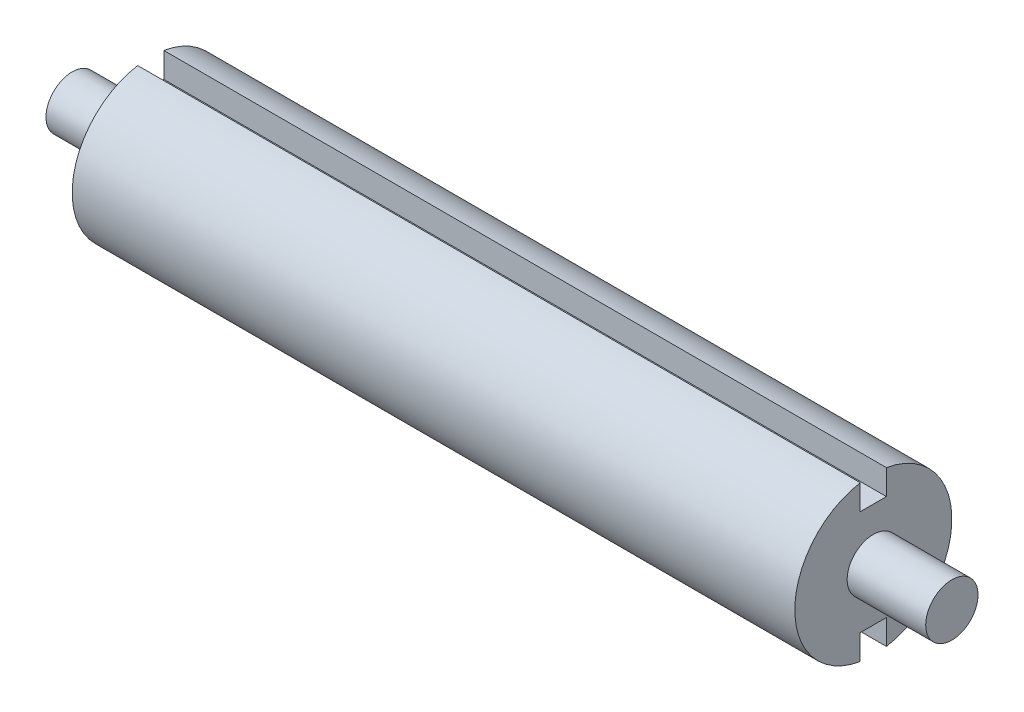
ISO-10303-21;
HEADER;
FILE_DESCRIPTION(('STEP AP214'),'2;1');
FILE_NAME('part.step','',(''),(''),'','','');
FILE_SCHEMA(('AUTOMOTIVE_DESIGN { 1 0 10303 214 1 1 1 1 }'));
ENDSEC;
DATA;
#1=APPLICATION_CONTEXT('core data for automotive mechanical design processes');
#2=APPLICATION_PROTOCOL_DEFINITION('international standard','automotive_design',2000,#1);
#3=PRODUCT_CONTEXT('',#1,'mechanical');
#4=PRODUCT('Part','Part','',(#3));
#5=PRODUCT_RELATED_PRODUCT_CATEGORY('part','',(#4));
#6=PRODUCT_DEFINITION_FORMATION('','',#4);
#7=PRODUCT_DEFINITION_CONTEXT('part definition',#1,'design');
#8=PRODUCT_DEFINITION('design','',#6,#7);
#9=PRODUCT_DEFINITION_SHAPE('','',#8);
#10=(LENGTH_UNIT() NAMED_UNIT(*) SI_UNIT(.MILLI.,.METRE.));
#11=(NAMED_UNIT(*) PLANE_ANGLE_UNIT() SI_UNIT($,.RADIAN.));
#12=(NAMED_UNIT(*) SI_UNIT($,.STERADIAN.) SOLID_ANGLE_UNIT());
#13=UNCERTAINTY_MEASURE_WITH_UNIT(LENGTH_MEASURE(1.E-05),#10,'distance_accuracy_value','');
#14=(GEOMETRIC_REPRESENTATION_CONTEXT(3) GLOBAL_UNCERTAINTY_ASSIGNED_CONTEXT((#13)) GLOBAL_UNIT_ASSIGNED_CONTEXT((#10,
#11,#12)) REPRESENTATION_CONTEXT('',''));
#15=CARTESIAN_POINT('',(0.,0.,0.));
#16=DIRECTION('',(0.,0.,1.));
#17=DIRECTION('',(1.,0.,0.));
#18=AXIS2_PLACEMENT_3D('',#15,#16,#17);
#19=CARTESIAN_POINT('',(-106.68,0.,0.));
#20=DIRECTION('',(-1.,0.,0.));
#21=DIRECTION('',(0.,0.,1.));
#22=AXIS2_PLACEMENT_3D('',#19,#20,#21);
#23=CYLINDRICAL_SURFACE('',#22,19.05);
#24=CARTESIAN_POINT('',(-87.63,0.,0.));
#25=DIRECTION('',(-1.,0.,0.));
#26=DIRECTION('',(0.,0.,1.));
#27=AXIS2_PLACEMENT_3D('',#24,#25,#26);
#28=CIRCLE('',#27,19.05);
#29=CARTESIAN_POINT('',(-87.63,18.7835533113413,-3.175));
#30=VERTEX_POINT('',#29);
#31=CARTESIAN_POINT('',(-87.63,-18.7835533113413,-3.175));
#32=VERTEX_POINT('',#31);
#33=EDGE_CURVE('E167',#30,#32,#28,.T.);
#34=ORIENTED_EDGE('',*,*,#33,.F.);
#35=DIRECTION('',(-1.,0.,0.));
#36=VECTOR('',#35,1.);
#37=CARTESIAN_POINT('',(-106.68,18.7835533113413,-3.175));
#38=LINE('',#37,#36);
#39=CARTESIAN_POINT('',(87.63,18.7835533113413,-3.175));
#40=VERTEX_POINT('',#39);
#41=EDGE_CURVE('E149',#30,#40,#38,.F.);
#42=ORIENTED_EDGE('',*,*,#41,.T.);
#43=CARTESIAN_POINT('',(87.63,0.,0.));
#44=DIRECTION('',(-1.,0.,0.));
#45=DIRECTION('',(0.,0.,1.));
#46=AXIS2_PLACEMENT_3D('',#43,#44,#45);
#47=CIRCLE('',#46,19.05);
#48=CARTESIAN_POINT('',(87.63,-18.7835533113413,-3.175));
#49=VERTEX_POINT('',#48);
#50=EDGE_CURVE('E163',#40,#49,#47,.T.);
#51=ORIENTED_EDGE('',*,*,#50,.T.);
#52=DIRECTION('',(-1.,0.,0.));
#53=VECTOR('',#52,1.);
#54=CARTESIAN_POINT('',(-106.68,-18.7835533113413,-3.175));
#55=LINE('',#54,#53);
#56=EDGE_CURVE('E49',#49,#32,#55,.T.);
#57=ORIENTED_EDGE('',*,*,#56,.T.);
#58=EDGE_LOOP('',(#34,#42,#51,#57));
#59=FACE_BOUND('',#58,.T.);
#60=ADVANCED_FACE('F34',(#59),#23,.T.);
#61=CARTESIAN_POINT('',(-106.68,0.,0.));
#62=DIRECTION('',(1.,0.,0.));
#63=DIRECTION('',(0.,0.,-1.));
#64=AXIS2_PLACEMENT_3D('',#61,#62,#63);
#65=PLANE('',#64);
#66=CARTESIAN_POINT('',(-106.68,0.,0.));
#67=DIRECTION('',(-1.,0.,0.));
#68=DIRECTION('',(0.,0.,1.));
#69=AXIS2_PLACEMENT_3D('',#66,#67,#68);
#70=CIRCLE('',#69,6.35);
#71=CARTESIAN_POINT('',(-106.68,0.,6.35));
#72=VERTEX_POINT('',#71);
#73=EDGE_CURVE('E171',#72,#72,#70,.T.);
#74=ORIENTED_EDGE('',*,*,#73,.T.);
#75=EDGE_LOOP('',(#74));
#76=FACE_BOUND('',#75,.T.);
#77=ADVANCED_FACE('F36',(#76),#65,.F.);
#78=CARTESIAN_POINT('',(-106.68,0.,0.));
#79=DIRECTION('',(-1.,0.,0.));
#80=DIRECTION('',(0.,0.,1.));
#81=AXIS2_PLACEMENT_3D('',#78,#79,#80);
#82=CYLINDRICAL_SURFACE('',#81,6.35);
#83=ORIENTED_EDGE('',*,*,#73,.F.);
#84=EDGE_LOOP('',(#83));
#85=FACE_BOUND('',#84,.T.);
#86=CARTESIAN_POINT('',(-87.63,0.,0.));
#87=DIRECTION('',(-1.,0.,0.));
#88=DIRECTION('',(0.,0.,1.));
#89=AXIS2_PLACEMENT_3D('',#86,#87,#88);
#90=CIRCLE('',#89,6.35);
#91=CARTESIAN_POINT('',(-87.63,0.,6.35));
#92=VERTEX_POINT('',#91);
#93=EDGE_CURVE('E168',#92,#92,#90,.T.);
#94=ORIENTED_EDGE('',*,*,#93,.T.);
#95=EDGE_LOOP('',(#94));
#96=FACE_BOUND('',#95,.T.);
#97=ADVANCED_FACE('F207',(#85,#96),#82,.T.);
#98=CARTESIAN_POINT('',(-87.63,0.,-6.35));
#99=DIRECTION('',(1.,0.,0.));
#100=DIRECTION('',(0.,0.,-1.));
#101=AXIS2_PLACEMENT_3D('',#98,#99,#100);
#102=PLANE('',#101);
#103=ORIENTED_EDGE('',*,*,#93,.F.);
#104=EDGE_LOOP('',(#103));
#105=FACE_BOUND('',#104,.T.);
#106=DIRECTION('',(0.,0.,-1.));
#107=VECTOR('',#106,1.);
#108=CARTESIAN_POINT('',(-87.63,12.7,-6.35));
#109=LINE('',#108,#107);
#110=CARTESIAN_POINT('',(-87.63,12.7,3.175));
#111=VERTEX_POINT('',#110);
#112=CARTESIAN_POINT('',(-87.63,12.7,-3.175));
#113=VERTEX_POINT('',#112);
#114=EDGE_CURVE('E107',#111,#113,#109,.T.);
#115=ORIENTED_EDGE('',*,*,#114,.T.);
#116=DIRECTION('',(0.,1.,0.));
#117=VECTOR('',#116,1.);
#118=CARTESIAN_POINT('',(-87.63,0.,-3.175));
#119=LINE('',#118,#117);
#120=EDGE_CURVE('E152',#113,#30,#119,.T.);
#121=ORIENTED_EDGE('',*,*,#120,.T.);
#122=ORIENTED_EDGE('',*,*,#33,.T.);
#123=DIRECTION('',(0.,1.,0.));
#124=VECTOR('',#123,1.);
#125=CARTESIAN_POINT('',(-87.63,0.,-3.175));
#126=LINE('',#125,#124);
#127=CARTESIAN_POINT('',(-87.63,-12.7,-3.175));
#128=VERTEX_POINT('',#127);
#129=EDGE_CURVE('E133',#32,#128,#126,.T.);
#130=ORIENTED_EDGE('',*,*,#129,.T.);
#131=DIRECTION('',(0.,0.,1.));
#132=VECTOR('',#131,1.);
#133=CARTESIAN_POINT('',(-87.63,-12.7,-6.35));
#134=LINE('',#133,#132);
#135=CARTESIAN_POINT('',(-87.63,-12.7,3.175));
#136=VERTEX_POINT('',#135);
#137=EDGE_CURVE('E136',#128,#136,#134,.T.);
#138=ORIENTED_EDGE('',*,*,#137,.T.);
#139=DIRECTION('',(0.,-1.,0.));
#140=VECTOR('',#139,1.);
#141=CARTESIAN_POINT('',(-87.63,0.,3.175));
#142=LINE('',#141,#140);
#143=CARTESIAN_POINT('',(-87.63,-18.7835533113413,3.175));
#144=VERTEX_POINT('',#143);
#145=EDGE_CURVE('E142',#136,#144,#142,.T.);
#146=ORIENTED_EDGE('',*,*,#145,.T.);
#147=CARTESIAN_POINT('',(-87.63,18.7835533113413,3.175));
#148=VERTEX_POINT('',#147);
#149=EDGE_CURVE('E164',#144,#148,#28,.T.);
#150=ORIENTED_EDGE('',*,*,#149,.T.);
#151=DIRECTION('',(0.,-1.,0.));
#152=VECTOR('',#151,1.);
#153=CARTESIAN_POINT('',(-87.63,0.,3.175));
#154=LINE('',#153,#152);
#155=EDGE_CURVE('E146',#148,#111,#154,.T.);
#156=ORIENTED_EDGE('',*,*,#155,.T.);
#157=EDGE_LOOP('',(#115,#121,#122,#130,#138,#146,#150,#156));
#158=FACE_BOUND('',#157,.T.);
#159=ADVANCED_FACE('F183',(#105,#158),#102,.F.);
#160=CARTESIAN_POINT('',(87.63,-18.7835533113413,3.175));
#161=VERTEX_POINT('',#160);
#162=CARTESIAN_POINT('',(87.63,18.7835533113413,3.175));
#163=VERTEX_POINT('',#162);
#164=EDGE_CURVE('E161',#161,#163,#47,.T.);
#165=ORIENTED_EDGE('',*,*,#164,.T.);
#166=DIRECTION('',(-1.,0.,0.));
#167=VECTOR('',#166,1.);
#168=CARTESIAN_POINT('',(-106.68,18.7835533113413,3.175));
#169=LINE('',#168,#167);
#170=EDGE_CURVE('E57',#163,#148,#169,.T.);
#171=ORIENTED_EDGE('',*,*,#170,.T.);
#172=ORIENTED_EDGE('',*,*,#149,.F.);
#173=DIRECTION('',(-1.,0.,0.));
#174=VECTOR('',#173,1.);
#175=CARTESIAN_POINT('',(-106.68,-18.7835533113413,3.175));
#176=LINE('',#175,#174);
#177=EDGE_CURVE('E139',#144,#161,#176,.F.);
#178=ORIENTED_EDGE('',*,*,#177,.T.);
#179=EDGE_LOOP('',(#165,#171,#172,#178));
#180=FACE_BOUND('',#179,.T.);
#181=ADVANCED_FACE('F186',(#180),#23,.T.);
#182=CARTESIAN_POINT('',(87.63,0.,-19.05));
#183=DIRECTION('',(-1.,0.,0.));
#184=DIRECTION('',(0.,0.,1.));
#185=AXIS2_PLACEMENT_3D('',#182,#183,#184);
#186=PLANE('',#185);
#187=ORIENTED_EDGE('',*,*,#50,.F.);
#188=DIRECTION('',(0.,1.,0.));
#189=VECTOR('',#188,1.);
#190=CARTESIAN_POINT('',(87.63,12.7,-3.175));
#191=LINE('',#190,#189);
#192=CARTESIAN_POINT('',(87.63,12.7,-3.175));
#193=VERTEX_POINT('',#192);
#194=EDGE_CURVE('E118',#193,#40,#191,.T.);
#195=ORIENTED_EDGE('',*,*,#194,.F.);
#196=DIRECTION('',(0.,0.,-1.));
#197=VECTOR('',#196,1.);
#198=CARTESIAN_POINT('',(87.63,12.7,3.175));
#199=LINE('',#198,#197);
#200=CARTESIAN_POINT('',(87.63,12.7,3.175));
#201=VERTEX_POINT('',#200);
#202=EDGE_CURVE('E104',#201,#193,#199,.T.);
#203=ORIENTED_EDGE('',*,*,#202,.F.);
#204=DIRECTION('',(0.,1.,0.));
#205=VECTOR('',#204,1.);
#206=CARTESIAN_POINT('',(87.63,0.,3.175));
#207=LINE('',#206,#205);
#208=EDGE_CURVE('E11',#201,#163,#207,.T.);
#209=ORIENTED_EDGE('',*,*,#208,.T.);
#210=ORIENTED_EDGE('',*,*,#164,.F.);
#211=DIRECTION('',(0.,-1.,0.));
#212=VECTOR('',#211,1.);
#213=CARTESIAN_POINT('',(87.63,-12.7,3.175));
#214=LINE('',#213,#212);
#215=CARTESIAN_POINT('',(87.63,-12.7,3.175));
#216=VERTEX_POINT('',#215);
#217=EDGE_CURVE('E124',#216,#161,#214,.T.);
#218=ORIENTED_EDGE('',*,*,#217,.F.);
#219=DIRECTION('',(0.,0.,1.));
#220=VECTOR('',#219,1.);
#221=CARTESIAN_POINT('',(87.63,-12.7,3.175));
#222=LINE('',#221,#220);
#223=CARTESIAN_POINT('',(87.63,-12.7,-3.175));
#224=VERTEX_POINT('',#223);
#225=EDGE_CURVE('E126',#224,#216,#222,.T.);
#226=ORIENTED_EDGE('',*,*,#225,.F.);
#227=DIRECTION('',(0.,-1.,0.));
#228=VECTOR('',#227,1.);
#229=CARTESIAN_POINT('',(87.63,0.,-3.175));
#230=LINE('',#229,#228);
#231=EDGE_CURVE('E42',#224,#49,#230,.T.);
#232=ORIENTED_EDGE('',*,*,#231,.T.);
#233=EDGE_LOOP('',(#187,#195,#203,#209,#210,#218,#226,#232));
#234=FACE_BOUND('',#233,.T.);
#235=CARTESIAN_POINT('',(87.63,0.,0.));
#236=DIRECTION('',(-1.,0.,0.));
#237=DIRECTION('',(0.,0.,1.));
#238=AXIS2_PLACEMENT_3D('',#235,#236,#237);
#239=CIRCLE('',#238,6.35);
#240=CARTESIAN_POINT('',(87.63,0.,6.35));
#241=VERTEX_POINT('',#240);
#242=EDGE_CURVE('E158',#241,#241,#239,.T.);
#243=ORIENTED_EDGE('',*,*,#242,.T.);
#244=EDGE_LOOP('',(#243));
#245=FACE_BOUND('',#244,.T.);
#246=ADVANCED_FACE('F116',(#234,#245),#186,.F.);
#247=CARTESIAN_POINT('',(-106.68,0.,0.));
#248=DIRECTION('',(-1.,0.,0.));
#249=DIRECTION('',(0.,0.,1.));
#250=AXIS2_PLACEMENT_3D('',#247,#248,#249);
#251=CYLINDRICAL_SURFACE('',#250,6.35);
#252=ORIENTED_EDGE('',*,*,#242,.F.);
#253=EDGE_LOOP('',(#252));
#254=FACE_BOUND('',#253,.T.);
#255=CARTESIAN_POINT('',(106.68,0.,0.));
#256=DIRECTION('',(-1.,0.,0.));
#257=DIRECTION('',(0.,0.,1.));
#258=AXIS2_PLACEMENT_3D('',#255,#256,#257);
#259=CIRCLE('',#258,6.35);
#260=CARTESIAN_POINT('',(106.68,0.,6.35));
#261=VERTEX_POINT('',#260);
#262=EDGE_CURVE('E155',#261,#261,#259,.T.);
#263=ORIENTED_EDGE('',*,*,#262,.T.);
#264=EDGE_LOOP('',(#263));
#265=FACE_BOUND('',#264,.T.);
#266=ADVANCED_FACE('F216',(#254,#265),#251,.T.);
#267=CARTESIAN_POINT('',(106.68,0.,-6.35));
#268=DIRECTION('',(-1.,0.,0.));
#269=DIRECTION('',(0.,0.,1.));
#270=AXIS2_PLACEMENT_3D('',#267,#268,#269);
#271=PLANE('',#270);
#272=ORIENTED_EDGE('',*,*,#262,.F.);
#273=EDGE_LOOP('',(#272));
#274=FACE_BOUND('',#273,.T.);
#275=ADVANCED_FACE('F257',(#274),#271,.F.);
#276=CARTESIAN_POINT('',(-106.68,-12.7,3.175));
#277=DIRECTION('',(0.,0.,1.));
#278=DIRECTION('',(1.,0.,0.));
#279=AXIS2_PLACEMENT_3D('',#276,#277,#278);
#280=PLANE('',#279);
#281=DIRECTION('',(1.,0.,0.));
#282=VECTOR('',#281,1.);
#283=CARTESIAN_POINT('',(-106.68,-12.7,3.175));
#284=LINE('',#283,#282);
#285=EDGE_CURVE('E120',#136,#216,#284,.T.);
#286=ORIENTED_EDGE('',*,*,#285,.T.);
#287=ORIENTED_EDGE('',*,*,#217,.T.);
#288=ORIENTED_EDGE('',*,*,#177,.F.);
#289=ORIENTED_EDGE('',*,*,#145,.F.);
#290=EDGE_LOOP('',(#286,#287,#288,#289));
#291=FACE_BOUND('',#290,.T.);
#292=ADVANCED_FACE('F188',(#291),#280,.F.);
#293=CARTESIAN_POINT('',(-106.68,-12.7,3.175));
#294=DIRECTION('',(0.,1.,0.));
#295=DIRECTION('',(0.,0.,1.));
#296=AXIS2_PLACEMENT_3D('',#293,#294,#295);
#297=PLANE('',#296);
#298=DIRECTION('',(1.,0.,0.));
#299=VECTOR('',#298,1.);
#300=CARTESIAN_POINT('',(-106.68,-12.7,-3.175));
#301=LINE('',#300,#299);
#302=EDGE_CURVE('E129',#128,#224,#301,.T.);
#303=ORIENTED_EDGE('',*,*,#302,.T.);
#304=ORIENTED_EDGE('',*,*,#225,.T.);
#305=ORIENTED_EDGE('',*,*,#285,.F.);
#306=ORIENTED_EDGE('',*,*,#137,.F.);
#307=EDGE_LOOP('',(#303,#304,#305,#306));
#308=FACE_BOUND('',#307,.T.);
#309=ADVANCED_FACE('F191',(#308),#297,.F.);
#310=CARTESIAN_POINT('',(-106.68,-12.7,-3.175));
#311=DIRECTION('',(0.,0.,-1.));
#312=DIRECTION('',(-1.,0.,0.));
#313=AXIS2_PLACEMENT_3D('',#310,#311,#312);
#314=PLANE('',#313);
#315=ORIENTED_EDGE('',*,*,#56,.F.);
#316=ORIENTED_EDGE('',*,*,#231,.F.);
#317=ORIENTED_EDGE('',*,*,#302,.F.);
#318=ORIENTED_EDGE('',*,*,#129,.F.);
#319=EDGE_LOOP('',(#315,#316,#317,#318));
#320=FACE_BOUND('',#319,.T.);
#321=ADVANCED_FACE('F192',(#320),#314,.F.);
#322=CARTESIAN_POINT('',(-106.68,12.7,-3.175));
#323=DIRECTION('',(0.,0.,-1.));
#324=DIRECTION('',(-1.,0.,0.));
#325=AXIS2_PLACEMENT_3D('',#322,#323,#324);
#326=PLANE('',#325);
#327=DIRECTION('',(1.,0.,0.));
#328=VECTOR('',#327,1.);
#329=CARTESIAN_POINT('',(-106.68,12.7,-3.175));
#330=LINE('',#329,#328);
#331=EDGE_CURVE('E109',#113,#193,#330,.T.);
#332=ORIENTED_EDGE('',*,*,#331,.T.);
#333=ORIENTED_EDGE('',*,*,#194,.T.);
#334=ORIENTED_EDGE('',*,*,#41,.F.);
#335=ORIENTED_EDGE('',*,*,#120,.F.);
#336=EDGE_LOOP('',(#332,#333,#334,#335));
#337=FACE_BOUND('',#336,.T.);
#338=ADVANCED_FACE('F181',(#337),#326,.F.);
#339=CARTESIAN_POINT('',(-106.68,12.7,3.175));
#340=DIRECTION('',(0.,-1.,0.));
#341=DIRECTION('',(0.,0.,-1.));
#342=AXIS2_PLACEMENT_3D('',#339,#340,#341);
#343=PLANE('',#342);
#344=DIRECTION('',(1.,0.,0.));
#345=VECTOR('',#344,1.);
#346=CARTESIAN_POINT('',(-106.68,12.7,3.175));
#347=LINE('',#346,#345);
#348=EDGE_CURVE('E100',#111,#201,#347,.T.);
#349=ORIENTED_EDGE('',*,*,#348,.T.);
#350=ORIENTED_EDGE('',*,*,#202,.T.);
#351=ORIENTED_EDGE('',*,*,#331,.F.);
#352=ORIENTED_EDGE('',*,*,#114,.F.);
#353=EDGE_LOOP('',(#349,#350,#351,#352));
#354=FACE_BOUND('',#353,.T.);
#355=ADVANCED_FACE('F101',(#354),#343,.F.);
#356=CARTESIAN_POINT('',(-106.68,12.7,3.175));
#357=DIRECTION('',(0.,0.,1.));
#358=DIRECTION('',(1.,0.,0.));
#359=AXIS2_PLACEMENT_3D('',#356,#357,#358);
#360=PLANE('',#359);
#361=ORIENTED_EDGE('',*,*,#170,.F.);
#362=ORIENTED_EDGE('',*,*,#208,.F.);
#363=ORIENTED_EDGE('',*,*,#348,.F.);
#364=ORIENTED_EDGE('',*,*,#155,.F.);
#365=EDGE_LOOP('',(#361,#362,#363,#364));
#366=FACE_BOUND('',#365,.T.);
#367=ADVANCED_FACE('F111',(#366),#360,.F.);
#368=CLOSED_SHELL('',(#60,#77,#97,#159,#181,#246,#266,#275,#292,#309,#321,#338,#355,#367));
#369=MANIFOLD_SOLID_BREP('B2',#368);
#370=ADVANCED_BREP_SHAPE_REPRESENTATION('',(#18,#369),#14);
#371=SHAPE_DEFINITION_REPRESENTATION(#9,#370);
ENDSEC;
END-ISO-10303-21;
